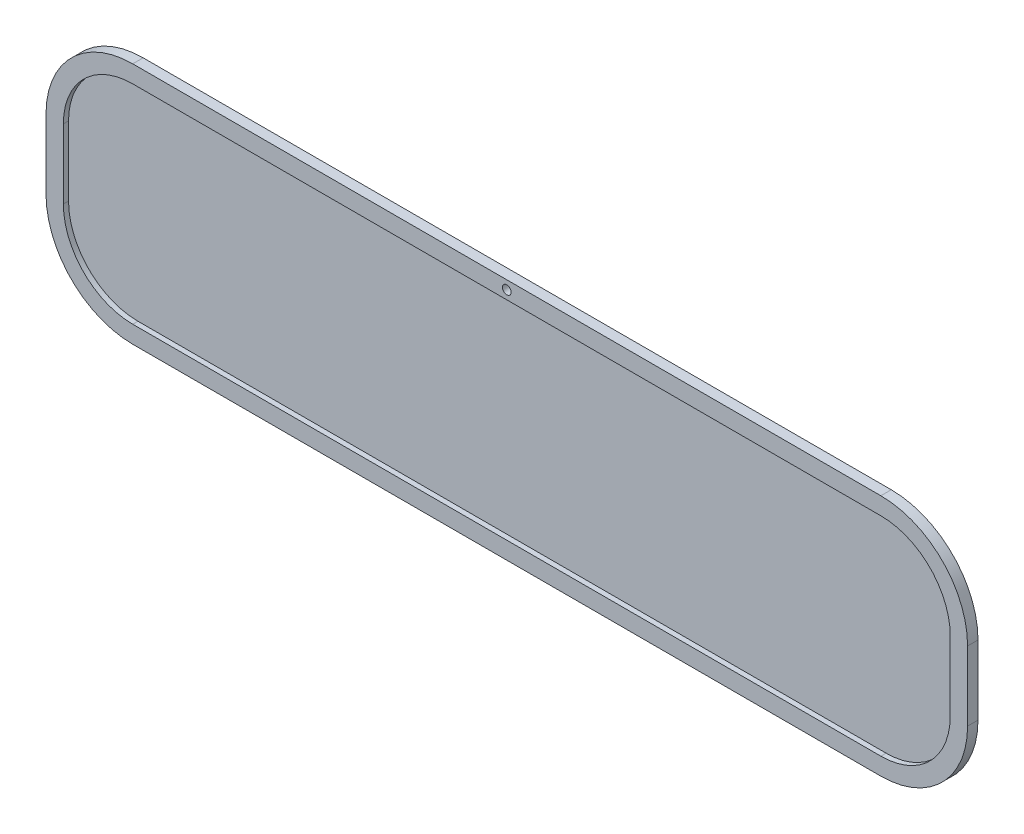
ISO-10303-21;
HEADER;
FILE_DESCRIPTION(('STEP AP214'),'2;1');
FILE_NAME('part.step','',(''),(''),'','','');
FILE_SCHEMA(('AUTOMOTIVE_DESIGN { 1 0 10303 214 1 1 1 1 }'));
ENDSEC;
DATA;
#1=APPLICATION_CONTEXT('core data for automotive mechanical design processes');
#2=APPLICATION_PROTOCOL_DEFINITION('international standard','automotive_design',2000,#1);
#3=PRODUCT_CONTEXT('',#1,'mechanical');
#4=PRODUCT('Part','Part','',(#3));
#5=PRODUCT_RELATED_PRODUCT_CATEGORY('part','',(#4));
#6=PRODUCT_DEFINITION_FORMATION('','',#4);
#7=PRODUCT_DEFINITION_CONTEXT('part definition',#1,'design');
#8=PRODUCT_DEFINITION('design','',#6,#7);
#9=PRODUCT_DEFINITION_SHAPE('','',#8);
#10=(LENGTH_UNIT() NAMED_UNIT(*) SI_UNIT(.MILLI.,.METRE.));
#11=(NAMED_UNIT(*) PLANE_ANGLE_UNIT() SI_UNIT($,.RADIAN.));
#12=(NAMED_UNIT(*) SI_UNIT($,.STERADIAN.) SOLID_ANGLE_UNIT());
#13=UNCERTAINTY_MEASURE_WITH_UNIT(LENGTH_MEASURE(1.E-05),#10,'distance_accuracy_value','');
#14=(GEOMETRIC_REPRESENTATION_CONTEXT(3) GLOBAL_UNCERTAINTY_ASSIGNED_CONTEXT((#13)) GLOBAL_UNIT_ASSIGNED_CONTEXT((#10,
#11,#12)) REPRESENTATION_CONTEXT('',''));
#15=CARTESIAN_POINT('',(0.,0.,0.));
#16=DIRECTION('',(0.,0.,1.));
#17=DIRECTION('',(1.,0.,0.));
#18=AXIS2_PLACEMENT_3D('',#15,#16,#17);
#19=CARTESIAN_POINT('',(432.051221512539,126.172344807286,3.));
#20=DIRECTION('',(-1.,0.,0.));
#21=DIRECTION('',(0.,-1.,0.));
#22=AXIS2_PLACEMENT_3D('',#19,#20,#21);
#23=PLANE('',#22);
#24=DIRECTION('',(0.,1.,0.));
#25=VECTOR('',#24,1.);
#26=CARTESIAN_POINT('',(432.051221512539,126.172344807286,0.));
#27=LINE('',#26,#25);
#28=CARTESIAN_POINT('',(432.051221512539,146.172344807286,0.));
#29=VERTEX_POINT('',#28);
#30=CARTESIAN_POINT('',(432.051221512539,186.172344807286,0.));
#31=VERTEX_POINT('',#30);
#32=EDGE_CURVE('E237',#29,#31,#27,.T.);
#33=ORIENTED_EDGE('',*,*,#32,.T.);
#34=DIRECTION('',(0.,0.,-1.));
#35=VECTOR('',#34,1.);
#36=CARTESIAN_POINT('',(432.051221512539,186.172344807286,3.));
#37=LINE('',#36,#35);
#38=CARTESIAN_POINT('',(432.051221512539,186.172344807286,6.));
#39=VERTEX_POINT('',#38);
#40=EDGE_CURVE('E11',#31,#39,#37,.F.);
#41=ORIENTED_EDGE('',*,*,#40,.T.);
#42=DIRECTION('',(0.,1.,0.));
#43=VECTOR('',#42,1.);
#44=CARTESIAN_POINT('',(432.051221512539,146.172344807286,6.));
#45=LINE('',#44,#43);
#46=CARTESIAN_POINT('',(432.051221512539,146.172344807286,6.));
#47=VERTEX_POINT('',#46);
#48=EDGE_CURVE('E216',#47,#39,#45,.T.);
#49=ORIENTED_EDGE('',*,*,#48,.F.);
#50=DIRECTION('',(0.,0.,-1.));
#51=VECTOR('',#50,1.);
#52=CARTESIAN_POINT('',(432.051221512539,146.172344807286,3.));
#53=LINE('',#52,#51);
#54=EDGE_CURVE('E248',#47,#29,#53,.T.);
#55=ORIENTED_EDGE('',*,*,#54,.T.);
#56=EDGE_LOOP('',(#33,#41,#49,#55));
#57=FACE_BOUND('',#56,.T.);
#58=ADVANCED_FACE('F34',(#57),#23,.F.);
#59=CARTESIAN_POINT('',(403.073446723839,236.172344807286,3.));
#60=DIRECTION('',(0.,-1.,0.));
#61=DIRECTION('',(1.,0.,0.));
#62=AXIS2_PLACEMENT_3D('',#59,#60,#61);
#63=PLANE('',#62);
#64=DIRECTION('',(0.,0.,-1.));
#65=VECTOR('',#64,1.);
#66=CARTESIAN_POINT('',(-49.2079829464613,236.172344807286,3.));
#67=LINE('',#66,#65);
#68=CARTESIAN_POINT('',(-49.2079829464612,236.172344807286,0.));
#69=VERTEX_POINT('',#68);
#70=CARTESIAN_POINT('',(-49.2079829464612,236.172344807286,6.));
#71=VERTEX_POINT('',#70);
#72=EDGE_CURVE('E268',#69,#71,#67,.F.);
#73=ORIENTED_EDGE('',*,*,#72,.T.);
#74=DIRECTION('',(-1.,0.,0.));
#75=VECTOR('',#74,1.);
#76=CARTESIAN_POINT('',(382.051221512539,236.172344807286,6.));
#77=LINE('',#76,#75);
#78=CARTESIAN_POINT('',(382.051221512539,236.172344807286,6.));
#79=VERTEX_POINT('',#78);
#80=EDGE_CURVE('E222',#79,#71,#77,.T.);
#81=ORIENTED_EDGE('',*,*,#80,.F.);
#82=DIRECTION('',(0.,0.,-1.));
#83=VECTOR('',#82,1.);
#84=CARTESIAN_POINT('',(382.051221512539,236.172344807286,3.));
#85=LINE('',#84,#83);
#86=CARTESIAN_POINT('',(382.051221512539,236.172344807286,0.));
#87=VERTEX_POINT('',#86);
#88=EDGE_CURVE('E270',#79,#87,#85,.T.);
#89=ORIENTED_EDGE('',*,*,#88,.T.);
#90=DIRECTION('',(-1.,0.,0.));
#91=VECTOR('',#90,1.);
#92=CARTESIAN_POINT('',(403.073446723839,236.172344807286,0.));
#93=LINE('',#92,#91);
#94=EDGE_CURVE('E240',#87,#69,#93,.T.);
#95=ORIENTED_EDGE('',*,*,#94,.T.);
#96=EDGE_LOOP('',(#73,#81,#89,#95));
#97=FACE_BOUND('',#96,.T.);
#98=ADVANCED_FACE('F286',(#97),#63,.F.);
#99=CARTESIAN_POINT('',(-99.2079829464613,206.172344807286,3.));
#100=DIRECTION('',(1.,0.,0.));
#101=DIRECTION('',(0.,0.,-1.));
#102=AXIS2_PLACEMENT_3D('',#99,#100,#101);
#103=PLANE('',#102);
#104=DIRECTION('',(0.,-1.,0.));
#105=VECTOR('',#104,1.);
#106=CARTESIAN_POINT('',(-99.2079829464613,206.172344807286,0.));
#107=LINE('',#106,#105);
#108=CARTESIAN_POINT('',(-99.2079829464613,186.172344807286,0.));
#109=VERTEX_POINT('',#108);
#110=CARTESIAN_POINT('',(-99.2079829464613,146.172344807286,0.));
#111=VERTEX_POINT('',#110);
#112=EDGE_CURVE('E242',#109,#111,#107,.T.);
#113=ORIENTED_EDGE('',*,*,#112,.T.);
#114=DIRECTION('',(0.,0.,-1.));
#115=VECTOR('',#114,1.);
#116=CARTESIAN_POINT('',(-99.2079829464613,146.172344807286,3.));
#117=LINE('',#116,#115);
#118=CARTESIAN_POINT('',(-99.2079829464613,146.172344807286,6.));
#119=VERTEX_POINT('',#118);
#120=EDGE_CURVE('E266',#111,#119,#117,.F.);
#121=ORIENTED_EDGE('',*,*,#120,.T.);
#122=DIRECTION('',(0.,-1.,0.));
#123=VECTOR('',#122,1.);
#124=CARTESIAN_POINT('',(-99.2079829464613,186.172344807286,6.));
#125=LINE('',#124,#123);
#126=CARTESIAN_POINT('',(-99.2079829464613,186.172344807286,6.));
#127=VERTEX_POINT('',#126);
#128=EDGE_CURVE('E228',#127,#119,#125,.T.);
#129=ORIENTED_EDGE('',*,*,#128,.F.);
#130=DIRECTION('',(0.,0.,-1.));
#131=VECTOR('',#130,1.);
#132=CARTESIAN_POINT('',(-99.2079829464613,186.172344807286,3.));
#133=LINE('',#132,#131);
#134=EDGE_CURVE('E263',#127,#109,#133,.T.);
#135=ORIENTED_EDGE('',*,*,#134,.T.);
#136=EDGE_LOOP('',(#113,#121,#129,#135));
#137=FACE_BOUND('',#136,.T.);
#138=ADVANCED_FACE('F293',(#137),#103,.F.);
#139=CARTESIAN_POINT('',(-70.2302081577613,96.1723448072857,3.));
#140=DIRECTION('',(0.,1.,0.));
#141=DIRECTION('',(0.,0.,1.));
#142=AXIS2_PLACEMENT_3D('',#139,#140,#141);
#143=PLANE('',#142);
#144=DIRECTION('',(1.,0.,0.));
#145=VECTOR('',#144,1.);
#146=CARTESIAN_POINT('',(-70.2302081577613,96.1723448072857,0.));
#147=LINE('',#146,#145);
#148=CARTESIAN_POINT('',(-49.2079829464613,96.1723448072857,0.));
#149=VERTEX_POINT('',#148);
#150=CARTESIAN_POINT('',(382.051221512539,96.1723448072857,0.));
#151=VERTEX_POINT('',#150);
#152=EDGE_CURVE('E245',#149,#151,#147,.T.);
#153=ORIENTED_EDGE('',*,*,#152,.T.);
#154=DIRECTION('',(0.,0.,-1.));
#155=VECTOR('',#154,1.);
#156=CARTESIAN_POINT('',(382.051221512539,96.1723448072857,3.));
#157=LINE('',#156,#155);
#158=CARTESIAN_POINT('',(382.051221512539,96.1723448072857,6.));
#159=VERTEX_POINT('',#158);
#160=EDGE_CURVE('E261',#151,#159,#157,.F.);
#161=ORIENTED_EDGE('',*,*,#160,.T.);
#162=DIRECTION('',(1.,0.,0.));
#163=VECTOR('',#162,1.);
#164=CARTESIAN_POINT('',(-49.2079829464613,96.1723448072857,6.));
#165=LINE('',#164,#163);
#166=CARTESIAN_POINT('',(-49.2079829464613,96.1723448072857,6.));
#167=VERTEX_POINT('',#166);
#168=EDGE_CURVE('E234',#167,#159,#165,.T.);
#169=ORIENTED_EDGE('',*,*,#168,.F.);
#170=DIRECTION('',(0.,0.,-1.));
#171=VECTOR('',#170,1.);
#172=CARTESIAN_POINT('',(-49.2079829464613,96.1723448072857,3.));
#173=LINE('',#172,#171);
#174=EDGE_CURVE('E258',#167,#149,#173,.T.);
#175=ORIENTED_EDGE('',*,*,#174,.T.);
#176=EDGE_LOOP('',(#153,#161,#169,#175));
#177=FACE_BOUND('',#176,.T.);
#178=ADVANCED_FACE('F301',(#177),#143,.F.);
#179=CARTESIAN_POINT('',(0.,0.,0.));
#180=DIRECTION('',(0.,0.,1.));
#181=DIRECTION('',(1.,0.,0.));
#182=AXIS2_PLACEMENT_3D('',#179,#180,#181);
#183=PLANE('',#182);
#184=CARTESIAN_POINT('',(166.421619283039,231.172344807286,0.));
#185=DIRECTION('',(0.,0.,1.));
#186=DIRECTION('',(1.,0.,0.));
#187=AXIS2_PLACEMENT_3D('',#184,#185,#186);
#188=CIRCLE('',#187,2.5);
#189=CARTESIAN_POINT('',(168.921619283039,231.172344807286,0.));
#190=VERTEX_POINT('',#189);
#191=EDGE_CURVE('E38',#190,#190,#188,.T.);
#192=ORIENTED_EDGE('',*,*,#191,.T.);
#193=EDGE_LOOP('',(#192));
#194=FACE_BOUND('',#193,.T.);
#195=ORIENTED_EDGE('',*,*,#94,.F.);
#196=CARTESIAN_POINT('',(382.051221512539,186.172344807286,0.));
#197=DIRECTION('',(0.,0.,1.));
#198=DIRECTION('',(1.,0.,0.));
#199=AXIS2_PLACEMENT_3D('',#196,#197,#198);
#200=CIRCLE('',#199,50.);
#201=EDGE_CURVE('E43',#87,#31,#200,.F.);
#202=ORIENTED_EDGE('',*,*,#201,.T.);
#203=ORIENTED_EDGE('',*,*,#32,.F.);
#204=CARTESIAN_POINT('',(382.051221512539,146.172344807286,0.));
#205=DIRECTION('',(0.,0.,1.));
#206=DIRECTION('',(1.,0.,0.));
#207=AXIS2_PLACEMENT_3D('',#204,#205,#206);
#208=CIRCLE('',#207,50.);
#209=EDGE_CURVE('E256',#29,#151,#208,.F.);
#210=ORIENTED_EDGE('',*,*,#209,.T.);
#211=ORIENTED_EDGE('',*,*,#152,.F.);
#212=CARTESIAN_POINT('',(-49.2079829464613,146.172344807286,0.));
#213=DIRECTION('',(0.,0.,1.));
#214=DIRECTION('',(1.,0.,0.));
#215=AXIS2_PLACEMENT_3D('',#212,#213,#214);
#216=CIRCLE('',#215,50.);
#217=EDGE_CURVE('E254',#149,#111,#216,.F.);
#218=ORIENTED_EDGE('',*,*,#217,.T.);
#219=ORIENTED_EDGE('',*,*,#112,.F.);
#220=CARTESIAN_POINT('',(-49.2079829464613,186.172344807286,0.));
#221=DIRECTION('',(0.,0.,1.));
#222=DIRECTION('',(1.,0.,0.));
#223=AXIS2_PLACEMENT_3D('',#220,#221,#222);
#224=CIRCLE('',#223,50.);
#225=EDGE_CURVE('E251',#109,#69,#224,.F.);
#226=ORIENTED_EDGE('',*,*,#225,.T.);
#227=EDGE_LOOP('',(#195,#202,#203,#210,#211,#218,#219,#226));
#228=FACE_BOUND('',#227,.T.);
#229=ADVANCED_FACE('F276',(#194,#228),#183,.F.);
#230=CARTESIAN_POINT('',(382.051221512539,146.172344807286,3.));
#231=DIRECTION('',(0.,0.,-1.));
#232=DIRECTION('',(-1.,0.,0.));
#233=AXIS2_PLACEMENT_3D('',#230,#231,#232);
#234=CYLINDRICAL_SURFACE('',#233,50.);
#235=ORIENTED_EDGE('',*,*,#54,.F.);
#236=CARTESIAN_POINT('',(382.051221512539,146.172344807286,6.));
#237=DIRECTION('',(0.,0.,1.));
#238=DIRECTION('',(1.,0.,0.));
#239=AXIS2_PLACEMENT_3D('',#236,#237,#238);
#240=CIRCLE('',#239,50.);
#241=EDGE_CURVE('E161',#159,#47,#240,.T.);
#242=ORIENTED_EDGE('',*,*,#241,.F.);
#243=ORIENTED_EDGE('',*,*,#160,.F.);
#244=ORIENTED_EDGE('',*,*,#209,.F.);
#245=EDGE_LOOP('',(#235,#242,#243,#244));
#246=FACE_BOUND('',#245,.T.);
#247=ADVANCED_FACE('F305',(#246),#234,.T.);
#248=CARTESIAN_POINT('',(-49.2079829464613,146.172344807286,3.));
#249=DIRECTION('',(0.,0.,-1.));
#250=DIRECTION('',(-1.,0.,0.));
#251=AXIS2_PLACEMENT_3D('',#248,#249,#250);
#252=CYLINDRICAL_SURFACE('',#251,50.);
#253=ORIENTED_EDGE('',*,*,#174,.F.);
#254=CARTESIAN_POINT('',(-49.2079829464613,146.172344807286,6.));
#255=DIRECTION('',(0.,0.,1.));
#256=DIRECTION('',(1.,0.,0.));
#257=AXIS2_PLACEMENT_3D('',#254,#255,#256);
#258=CIRCLE('',#257,50.);
#259=EDGE_CURVE('E231',#119,#167,#258,.T.);
#260=ORIENTED_EDGE('',*,*,#259,.F.);
#261=ORIENTED_EDGE('',*,*,#120,.F.);
#262=ORIENTED_EDGE('',*,*,#217,.F.);
#263=EDGE_LOOP('',(#253,#260,#261,#262));
#264=FACE_BOUND('',#263,.T.);
#265=ADVANCED_FACE('F297',(#264),#252,.T.);
#266=CARTESIAN_POINT('',(-49.2079829464613,186.172344807286,3.));
#267=DIRECTION('',(0.,0.,-1.));
#268=DIRECTION('',(-1.,0.,0.));
#269=AXIS2_PLACEMENT_3D('',#266,#267,#268);
#270=CYLINDRICAL_SURFACE('',#269,50.);
#271=ORIENTED_EDGE('',*,*,#134,.F.);
#272=CARTESIAN_POINT('',(-49.2079829464613,186.172344807286,6.));
#273=DIRECTION('',(0.,0.,1.));
#274=DIRECTION('',(1.,0.,0.));
#275=AXIS2_PLACEMENT_3D('',#272,#273,#274);
#276=CIRCLE('',#275,50.);
#277=EDGE_CURVE('E225',#71,#127,#276,.T.);
#278=ORIENTED_EDGE('',*,*,#277,.F.);
#279=ORIENTED_EDGE('',*,*,#72,.F.);
#280=ORIENTED_EDGE('',*,*,#225,.F.);
#281=EDGE_LOOP('',(#271,#278,#279,#280));
#282=FACE_BOUND('',#281,.T.);
#283=ADVANCED_FACE('F289',(#282),#270,.T.);
#284=CARTESIAN_POINT('',(382.051221512539,186.172344807286,3.));
#285=DIRECTION('',(0.,0.,-1.));
#286=DIRECTION('',(-1.,0.,0.));
#287=AXIS2_PLACEMENT_3D('',#284,#285,#286);
#288=CYLINDRICAL_SURFACE('',#287,50.);
#289=ORIENTED_EDGE('',*,*,#88,.F.);
#290=CARTESIAN_POINT('',(382.051221512539,186.172344807286,6.));
#291=DIRECTION('',(0.,0.,1.));
#292=DIRECTION('',(1.,0.,0.));
#293=AXIS2_PLACEMENT_3D('',#290,#291,#292);
#294=CIRCLE('',#293,50.);
#295=EDGE_CURVE('E219',#39,#79,#294,.T.);
#296=ORIENTED_EDGE('',*,*,#295,.F.);
#297=ORIENTED_EDGE('',*,*,#40,.F.);
#298=ORIENTED_EDGE('',*,*,#201,.F.);
#299=EDGE_LOOP('',(#289,#296,#297,#298));
#300=FACE_BOUND('',#299,.T.);
#301=ADVANCED_FACE('F36',(#300),#288,.T.);
#302=CARTESIAN_POINT('',(166.421619283039,231.172344807286,-7.));
#303=DIRECTION('',(0.,0.,1.));
#304=DIRECTION('',(1.,0.,0.));
#305=AXIS2_PLACEMENT_3D('',#302,#303,#304);
#306=CYLINDRICAL_SURFACE('',#305,2.5);
#307=ORIENTED_EDGE('',*,*,#191,.F.);
#308=EDGE_LOOP('',(#307));
#309=FACE_BOUND('',#308,.T.);
#310=CARTESIAN_POINT('',(166.421619283039,231.172344807286,6.));
#311=DIRECTION('',(0.,0.,-1.));
#312=DIRECTION('',(-1.,0.,0.));
#313=AXIS2_PLACEMENT_3D('',#310,#311,#312);
#314=CIRCLE('',#313,2.5);
#315=CARTESIAN_POINT('',(163.921619283039,231.172344807286,6.));
#316=VERTEX_POINT('',#315);
#317=EDGE_CURVE('E184',#316,#316,#314,.T.);
#318=ORIENTED_EDGE('',*,*,#317,.F.);
#319=EDGE_LOOP('',(#318));
#320=FACE_BOUND('',#319,.T.);
#321=ADVANCED_FACE('F330',(#309,#320),#306,.F.);
#322=CARTESIAN_POINT('',(382.051221512539,146.172344807286,6.));
#323=DIRECTION('',(0.,0.,1.));
#324=DIRECTION('',(1.,0.,0.));
#325=AXIS2_PLACEMENT_3D('',#322,#323,#324);
#326=PLANE('',#325);
#327=ORIENTED_EDGE('',*,*,#317,.T.);
#328=EDGE_LOOP('',(#327));
#329=FACE_BOUND('',#328,.T.);
#330=ORIENTED_EDGE('',*,*,#241,.T.);
#331=ORIENTED_EDGE('',*,*,#48,.T.);
#332=ORIENTED_EDGE('',*,*,#295,.T.);
#333=ORIENTED_EDGE('',*,*,#80,.T.);
#334=ORIENTED_EDGE('',*,*,#277,.T.);
#335=ORIENTED_EDGE('',*,*,#128,.T.);
#336=ORIENTED_EDGE('',*,*,#259,.T.);
#337=ORIENTED_EDGE('',*,*,#168,.T.);
#338=EDGE_LOOP('',(#330,#331,#332,#333,#334,#335,#336,#337));
#339=FACE_BOUND('',#338,.T.);
#340=DIRECTION('',(0.,-1.,0.));
#341=VECTOR('',#340,1.);
#342=CARTESIAN_POINT('',(-89.2079829464613,186.172344807286,6.));
#343=LINE('',#342,#341);
#344=CARTESIAN_POINT('',(-89.2079829464613,186.172344807286,6.));
#345=VERTEX_POINT('',#344);
#346=CARTESIAN_POINT('',(-89.2079829464613,146.172344807286,6.));
#347=VERTEX_POINT('',#346);
#348=EDGE_CURVE('E155',#345,#347,#343,.T.);
#349=ORIENTED_EDGE('',*,*,#348,.F.);
#350=CARTESIAN_POINT('',(-49.2079829464613,186.172344807286,6.));
#351=DIRECTION('',(0.,0.,1.));
#352=DIRECTION('',(1.,0.,0.));
#353=AXIS2_PLACEMENT_3D('',#350,#351,#352);
#354=CIRCLE('',#353,40.);
#355=CARTESIAN_POINT('',(-49.2079829464612,226.172344807286,6.));
#356=VERTEX_POINT('',#355);
#357=EDGE_CURVE('E146',#356,#345,#354,.T.);
#358=ORIENTED_EDGE('',*,*,#357,.F.);
#359=DIRECTION('',(-1.,0.,0.));
#360=VECTOR('',#359,1.);
#361=CARTESIAN_POINT('',(382.051221512539,226.172344807286,6.));
#362=LINE('',#361,#360);
#363=CARTESIAN_POINT('',(382.051221512539,226.172344807286,6.));
#364=VERTEX_POINT('',#363);
#365=EDGE_CURVE('E181',#364,#356,#362,.T.);
#366=ORIENTED_EDGE('',*,*,#365,.F.);
#367=CARTESIAN_POINT('',(382.051221512539,186.172344807286,6.));
#368=DIRECTION('',(0.,0.,1.));
#369=DIRECTION('',(1.,0.,0.));
#370=AXIS2_PLACEMENT_3D('',#367,#368,#369);
#371=CIRCLE('',#370,40.);
#372=CARTESIAN_POINT('',(422.051221512539,186.172344807286,6.));
#373=VERTEX_POINT('',#372);
#374=EDGE_CURVE('E178',#373,#364,#371,.T.);
#375=ORIENTED_EDGE('',*,*,#374,.F.);
#376=DIRECTION('',(0.,1.,0.));
#377=VECTOR('',#376,1.);
#378=CARTESIAN_POINT('',(422.051221512539,146.172344807286,6.));
#379=LINE('',#378,#377);
#380=CARTESIAN_POINT('',(422.051221512539,146.172344807286,6.));
#381=VERTEX_POINT('',#380);
#382=EDGE_CURVE('E176',#381,#373,#379,.T.);
#383=ORIENTED_EDGE('',*,*,#382,.F.);
#384=CARTESIAN_POINT('',(382.051221512539,146.172344807286,6.));
#385=DIRECTION('',(0.,0.,1.));
#386=DIRECTION('',(1.,0.,0.));
#387=AXIS2_PLACEMENT_3D('',#384,#385,#386);
#388=CIRCLE('',#387,40.);
#389=CARTESIAN_POINT('',(382.051221512539,106.172344807286,6.));
#390=VERTEX_POINT('',#389);
#391=EDGE_CURVE('E174',#390,#381,#388,.T.);
#392=ORIENTED_EDGE('',*,*,#391,.F.);
#393=DIRECTION('',(1.,0.,0.));
#394=VECTOR('',#393,1.);
#395=CARTESIAN_POINT('',(-49.2079829464613,106.172344807286,6.));
#396=LINE('',#395,#394);
#397=CARTESIAN_POINT('',(-49.2079829464613,106.172344807286,6.));
#398=VERTEX_POINT('',#397);
#399=EDGE_CURVE('E169',#398,#390,#396,.T.);
#400=ORIENTED_EDGE('',*,*,#399,.F.);
#401=CARTESIAN_POINT('',(-49.2079829464613,146.172344807286,6.));
#402=DIRECTION('',(0.,0.,1.));
#403=DIRECTION('',(1.,0.,0.));
#404=AXIS2_PLACEMENT_3D('',#401,#402,#403);
#405=CIRCLE('',#404,40.);
#406=EDGE_CURVE('E167',#347,#398,#405,.T.);
#407=ORIENTED_EDGE('',*,*,#406,.F.);
#408=EDGE_LOOP('',(#349,#358,#366,#375,#383,#392,#400,#407));
#409=FACE_BOUND('',#408,.T.);
#410=ADVANCED_FACE('F165',(#329,#339,#409),#326,.T.);
#411=CARTESIAN_POINT('',(-49.2079829464613,186.172344807286,6.));
#412=DIRECTION('',(0.,0.,-1.));
#413=DIRECTION('',(-1.,0.,0.));
#414=AXIS2_PLACEMENT_3D('',#411,#412,#413);
#415=CYLINDRICAL_SURFACE('',#414,40.);
#416=CARTESIAN_POINT('',(-49.2079829464613,186.172344807286,3.));
#417=DIRECTION('',(0.,0.,1.));
#418=DIRECTION('',(1.,0.,0.));
#419=AXIS2_PLACEMENT_3D('',#416,#417,#418);
#420=CIRCLE('',#419,40.);
#421=CARTESIAN_POINT('',(-49.2079829464612,226.172344807286,3.));
#422=VERTEX_POINT('',#421);
#423=CARTESIAN_POINT('',(-89.2079829464613,186.172344807286,3.));
#424=VERTEX_POINT('',#423);
#425=EDGE_CURVE('E50',#422,#424,#420,.T.);
#426=ORIENTED_EDGE('',*,*,#425,.F.);
#427=DIRECTION('',(0.,0.,-1.));
#428=VECTOR('',#427,1.);
#429=CARTESIAN_POINT('',(-49.2079829464612,226.172344807286,6.));
#430=LINE('',#429,#428);
#431=EDGE_CURVE('E151',#356,#422,#430,.T.);
#432=ORIENTED_EDGE('',*,*,#431,.F.);
#433=ORIENTED_EDGE('',*,*,#357,.T.);
#434=DIRECTION('',(0.,0.,-1.));
#435=VECTOR('',#434,1.);
#436=CARTESIAN_POINT('',(-89.2079829464613,186.172344807286,6.));
#437=LINE('',#436,#435);
#438=EDGE_CURVE('E149',#345,#424,#437,.T.);
#439=ORIENTED_EDGE('',*,*,#438,.T.);
#440=EDGE_LOOP('',(#426,#432,#433,#439));
#441=FACE_BOUND('',#440,.T.);
#442=ADVANCED_FACE('F148',(#441),#415,.F.);
#443=CARTESIAN_POINT('',(-89.2079829464613,186.172344807286,6.));
#444=DIRECTION('',(1.,0.,0.));
#445=DIRECTION('',(0.,1.,0.));
#446=AXIS2_PLACEMENT_3D('',#443,#444,#445);
#447=PLANE('',#446);
#448=DIRECTION('',(0.,-1.,0.));
#449=VECTOR('',#448,1.);
#450=CARTESIAN_POINT('',(-89.2079829464613,186.172344807286,3.));
#451=LINE('',#450,#449);
#452=CARTESIAN_POINT('',(-89.2079829464613,146.172344807286,3.));
#453=VERTEX_POINT('',#452);
#454=EDGE_CURVE('E54',#424,#453,#451,.T.);
#455=ORIENTED_EDGE('',*,*,#454,.F.);
#456=ORIENTED_EDGE('',*,*,#438,.F.);
#457=ORIENTED_EDGE('',*,*,#348,.T.);
#458=DIRECTION('',(0.,0.,-1.));
#459=VECTOR('',#458,1.);
#460=CARTESIAN_POINT('',(-89.2079829464613,146.172344807286,6.));
#461=LINE('',#460,#459);
#462=EDGE_CURVE('E162',#347,#453,#461,.T.);
#463=ORIENTED_EDGE('',*,*,#462,.T.);
#464=EDGE_LOOP('',(#455,#456,#457,#463));
#465=FACE_BOUND('',#464,.T.);
#466=ADVANCED_FACE('F159',(#465),#447,.T.);
#467=CARTESIAN_POINT('',(-49.2079829464613,146.172344807286,6.));
#468=DIRECTION('',(0.,0.,-1.));
#469=DIRECTION('',(-1.,0.,0.));
#470=AXIS2_PLACEMENT_3D('',#467,#468,#469);
#471=CYLINDRICAL_SURFACE('',#470,40.);
#472=CARTESIAN_POINT('',(-49.2079829464613,146.172344807286,3.));
#473=DIRECTION('',(0.,0.,1.));
#474=DIRECTION('',(1.,0.,0.));
#475=AXIS2_PLACEMENT_3D('',#472,#473,#474);
#476=CIRCLE('',#475,40.);
#477=CARTESIAN_POINT('',(-49.2079829464613,106.172344807286,3.));
#478=VERTEX_POINT('',#477);
#479=EDGE_CURVE('E186',#453,#478,#476,.T.);
#480=ORIENTED_EDGE('',*,*,#479,.F.);
#481=ORIENTED_EDGE('',*,*,#462,.F.);
#482=ORIENTED_EDGE('',*,*,#406,.T.);
#483=DIRECTION('',(0.,0.,-1.));
#484=VECTOR('',#483,1.);
#485=CARTESIAN_POINT('',(-49.2079829464613,106.172344807286,6.));
#486=LINE('',#485,#484);
#487=EDGE_CURVE('E210',#398,#478,#486,.T.);
#488=ORIENTED_EDGE('',*,*,#487,.T.);
#489=EDGE_LOOP('',(#480,#481,#482,#488));
#490=FACE_BOUND('',#489,.T.);
#491=ADVANCED_FACE('F341',(#490),#471,.F.);
#492=CARTESIAN_POINT('',(-49.2079829464613,106.172344807286,6.));
#493=DIRECTION('',(0.,1.,0.));
#494=DIRECTION('',(0.,0.,1.));
#495=AXIS2_PLACEMENT_3D('',#492,#493,#494);
#496=PLANE('',#495);
#497=DIRECTION('',(1.,0.,0.));
#498=VECTOR('',#497,1.);
#499=CARTESIAN_POINT('',(-49.2079829464613,106.172344807286,3.));
#500=LINE('',#499,#498);
#501=CARTESIAN_POINT('',(382.051221512539,106.172344807286,3.));
#502=VERTEX_POINT('',#501);
#503=EDGE_CURVE('E188',#478,#502,#500,.T.);
#504=ORIENTED_EDGE('',*,*,#503,.F.);
#505=ORIENTED_EDGE('',*,*,#487,.F.);
#506=ORIENTED_EDGE('',*,*,#399,.T.);
#507=DIRECTION('',(0.,0.,-1.));
#508=VECTOR('',#507,1.);
#509=CARTESIAN_POINT('',(382.051221512539,106.172344807286,6.));
#510=LINE('',#509,#508);
#511=EDGE_CURVE('E207',#390,#502,#510,.T.);
#512=ORIENTED_EDGE('',*,*,#511,.T.);
#513=EDGE_LOOP('',(#504,#505,#506,#512));
#514=FACE_BOUND('',#513,.T.);
#515=ADVANCED_FACE('F344',(#514),#496,.T.);
#516=CARTESIAN_POINT('',(382.051221512539,146.172344807286,6.));
#517=DIRECTION('',(0.,0.,-1.));
#518=DIRECTION('',(-1.,0.,0.));
#519=AXIS2_PLACEMENT_3D('',#516,#517,#518);
#520=CYLINDRICAL_SURFACE('',#519,40.);
#521=CARTESIAN_POINT('',(382.051221512539,146.172344807286,3.));
#522=DIRECTION('',(0.,0.,1.));
#523=DIRECTION('',(1.,0.,0.));
#524=AXIS2_PLACEMENT_3D('',#521,#522,#523);
#525=CIRCLE('',#524,40.);
#526=CARTESIAN_POINT('',(422.051221512539,146.172344807286,3.));
#527=VERTEX_POINT('',#526);
#528=EDGE_CURVE('E190',#502,#527,#525,.T.);
#529=ORIENTED_EDGE('',*,*,#528,.F.);
#530=ORIENTED_EDGE('',*,*,#511,.F.);
#531=ORIENTED_EDGE('',*,*,#391,.T.);
#532=DIRECTION('',(0.,0.,-1.));
#533=VECTOR('',#532,1.);
#534=CARTESIAN_POINT('',(422.051221512539,146.172344807286,6.));
#535=LINE('',#534,#533);
#536=EDGE_CURVE('E204',#381,#527,#535,.T.);
#537=ORIENTED_EDGE('',*,*,#536,.T.);
#538=EDGE_LOOP('',(#529,#530,#531,#537));
#539=FACE_BOUND('',#538,.T.);
#540=ADVANCED_FACE('F348',(#539),#520,.F.);
#541=CARTESIAN_POINT('',(422.051221512539,146.172344807286,6.));
#542=DIRECTION('',(-1.,0.,0.));
#543=DIRECTION('',(0.,0.,1.));
#544=AXIS2_PLACEMENT_3D('',#541,#542,#543);
#545=PLANE('',#544);
#546=DIRECTION('',(0.,1.,0.));
#547=VECTOR('',#546,1.);
#548=CARTESIAN_POINT('',(422.051221512539,146.172344807286,3.));
#549=LINE('',#548,#547);
#550=CARTESIAN_POINT('',(422.051221512539,186.172344807286,3.));
#551=VERTEX_POINT('',#550);
#552=EDGE_CURVE('E192',#527,#551,#549,.T.);
#553=ORIENTED_EDGE('',*,*,#552,.F.);
#554=ORIENTED_EDGE('',*,*,#536,.F.);
#555=ORIENTED_EDGE('',*,*,#382,.T.);
#556=DIRECTION('',(0.,0.,-1.));
#557=VECTOR('',#556,1.);
#558=CARTESIAN_POINT('',(422.051221512539,186.172344807286,6.));
#559=LINE('',#558,#557);
#560=EDGE_CURVE('E201',#373,#551,#559,.T.);
#561=ORIENTED_EDGE('',*,*,#560,.T.);
#562=EDGE_LOOP('',(#553,#554,#555,#561));
#563=FACE_BOUND('',#562,.T.);
#564=ADVANCED_FACE('F352',(#563),#545,.T.);
#565=CARTESIAN_POINT('',(382.051221512539,186.172344807286,6.));
#566=DIRECTION('',(0.,0.,-1.));
#567=DIRECTION('',(-1.,0.,0.));
#568=AXIS2_PLACEMENT_3D('',#565,#566,#567);
#569=CYLINDRICAL_SURFACE('',#568,40.);
#570=CARTESIAN_POINT('',(382.051221512539,186.172344807286,3.));
#571=DIRECTION('',(0.,0.,1.));
#572=DIRECTION('',(1.,0.,0.));
#573=AXIS2_PLACEMENT_3D('',#570,#571,#572);
#574=CIRCLE('',#573,40.);
#575=CARTESIAN_POINT('',(382.051221512539,226.172344807286,3.));
#576=VERTEX_POINT('',#575);
#577=EDGE_CURVE('E194',#551,#576,#574,.T.);
#578=ORIENTED_EDGE('',*,*,#577,.F.);
#579=ORIENTED_EDGE('',*,*,#560,.F.);
#580=ORIENTED_EDGE('',*,*,#374,.T.);
#581=DIRECTION('',(0.,0.,-1.));
#582=VECTOR('',#581,1.);
#583=CARTESIAN_POINT('',(382.051221512539,226.172344807286,6.));
#584=LINE('',#583,#582);
#585=EDGE_CURVE('E198',#364,#576,#584,.T.);
#586=ORIENTED_EDGE('',*,*,#585,.T.);
#587=EDGE_LOOP('',(#578,#579,#580,#586));
#588=FACE_BOUND('',#587,.T.);
#589=ADVANCED_FACE('F356',(#588),#569,.F.);
#590=CARTESIAN_POINT('',(382.051221512539,226.172344807286,6.));
#591=DIRECTION('',(0.,-1.,0.));
#592=DIRECTION('',(0.,0.,-1.));
#593=AXIS2_PLACEMENT_3D('',#590,#591,#592);
#594=PLANE('',#593);
#595=DIRECTION('',(-1.,0.,0.));
#596=VECTOR('',#595,1.);
#597=CARTESIAN_POINT('',(382.051221512539,226.172344807286,3.));
#598=LINE('',#597,#596);
#599=EDGE_CURVE('E156',#576,#422,#598,.T.);
#600=ORIENTED_EDGE('',*,*,#599,.F.);
#601=ORIENTED_EDGE('',*,*,#585,.F.);
#602=ORIENTED_EDGE('',*,*,#365,.T.);
#603=ORIENTED_EDGE('',*,*,#431,.T.);
#604=EDGE_LOOP('',(#600,#601,#602,#603));
#605=FACE_BOUND('',#604,.T.);
#606=ADVANCED_FACE('F329',(#605),#594,.T.);
#607=CARTESIAN_POINT('',(0.,0.,3.));
#608=DIRECTION('',(0.,0.,1.));
#609=DIRECTION('',(1.,0.,0.));
#610=AXIS2_PLACEMENT_3D('',#607,#608,#609);
#611=PLANE('',#610);
#612=ORIENTED_EDGE('',*,*,#425,.T.);
#613=ORIENTED_EDGE('',*,*,#454,.T.);
#614=ORIENTED_EDGE('',*,*,#479,.T.);
#615=ORIENTED_EDGE('',*,*,#503,.T.);
#616=ORIENTED_EDGE('',*,*,#528,.T.);
#617=ORIENTED_EDGE('',*,*,#552,.T.);
#618=ORIENTED_EDGE('',*,*,#577,.T.);
#619=ORIENTED_EDGE('',*,*,#599,.T.);
#620=EDGE_LOOP('',(#612,#613,#614,#615,#616,#617,#618,#619));
#621=FACE_BOUND('',#620,.T.);
#622=ADVANCED_FACE('F326',(#621),#611,.T.);
#623=CLOSED_SHELL('',(#58,#98,#138,#178,#229,#247,#265,#283,#301,#321,#410,#442,#466,#491,#515,
#540,#564,#589,#606,#622));
#624=MANIFOLD_SOLID_BREP('B2',#623);
#625=ADVANCED_BREP_SHAPE_REPRESENTATION('',(#18,#624),#14);
#626=SHAPE_DEFINITION_REPRESENTATION(#9,#625);
ENDSEC;
END-ISO-10303-21;
